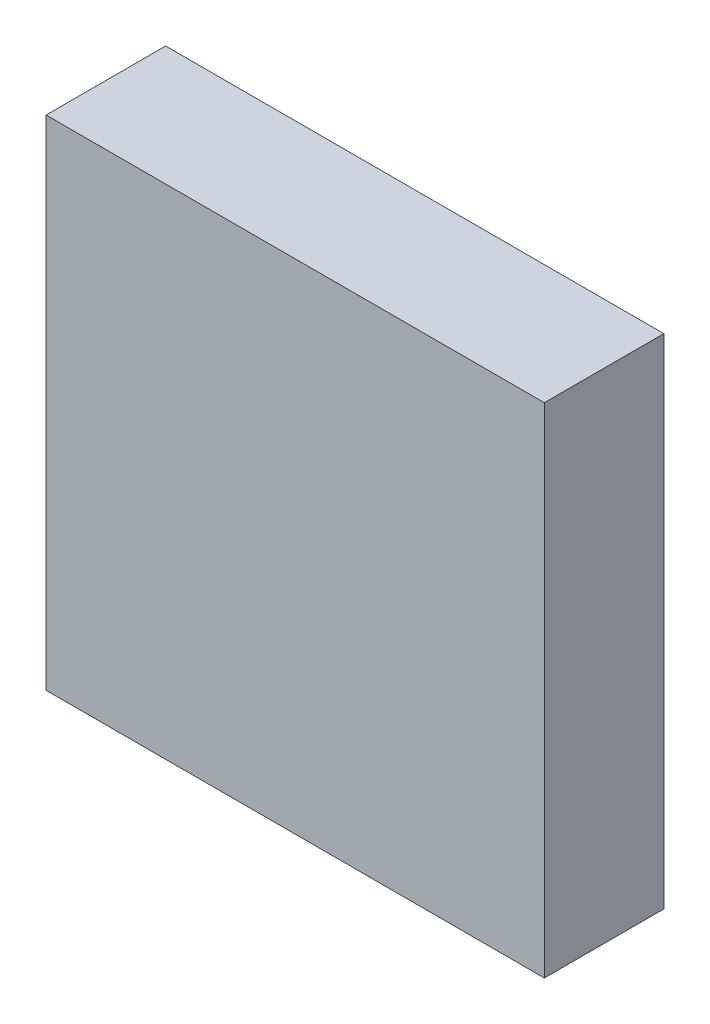
ISO-10303-21;
HEADER;
FILE_DESCRIPTION(('STEP AP214'),'2;1');
FILE_NAME('part.step','',(''),(''),'','','');
FILE_SCHEMA(('AUTOMOTIVE_DESIGN { 1 0 10303 214 1 1 1 1 }'));
ENDSEC;
DATA;
#1=APPLICATION_CONTEXT('core data for automotive mechanical design processes');
#2=APPLICATION_PROTOCOL_DEFINITION('international standard','automotive_design',2000,#1);
#3=PRODUCT_CONTEXT('',#1,'mechanical');
#4=PRODUCT('Part','Part','',(#3));
#5=PRODUCT_RELATED_PRODUCT_CATEGORY('part','',(#4));
#6=PRODUCT_DEFINITION_FORMATION('','',#4);
#7=PRODUCT_DEFINITION_CONTEXT('part definition',#1,'design');
#8=PRODUCT_DEFINITION('design','',#6,#7);
#9=PRODUCT_DEFINITION_SHAPE('','',#8);
#10=(LENGTH_UNIT() NAMED_UNIT(*) SI_UNIT(.MILLI.,.METRE.));
#11=(NAMED_UNIT(*) PLANE_ANGLE_UNIT() SI_UNIT($,.RADIAN.));
#12=(NAMED_UNIT(*) SI_UNIT($,.STERADIAN.) SOLID_ANGLE_UNIT());
#13=UNCERTAINTY_MEASURE_WITH_UNIT(LENGTH_MEASURE(1.E-05),#10,'distance_accuracy_value','');
#14=(GEOMETRIC_REPRESENTATION_CONTEXT(3) GLOBAL_UNCERTAINTY_ASSIGNED_CONTEXT((#13)) GLOBAL_UNIT_ASSIGNED_CONTEXT((#10,
#11,#12)) REPRESENTATION_CONTEXT('',''));
#15=CARTESIAN_POINT('',(0.,0.,0.));
#16=DIRECTION('',(0.,0.,1.));
#17=DIRECTION('',(1.,0.,0.));
#18=AXIS2_PLACEMENT_3D('',#15,#16,#17);
#19=CARTESIAN_POINT('',(16.,42.5,54.));
#20=DIRECTION('',(-1.,0.,0.));
#21=DIRECTION('',(0.,1.,0.));
#22=AXIS2_PLACEMENT_3D('',#19,#20,#21);
#23=PLANE('',#22);
#24=DIRECTION('',(0.,0.,1.));
#25=VECTOR('',#24,1.);
#26=CARTESIAN_POINT('',(16.,42.5,54.));
#27=LINE('',#26,#25);
#28=CARTESIAN_POINT('',(16.,42.5,54.));
#29=VERTEX_POINT('',#28);
#30=CARTESIAN_POINT('',(16.,42.5,60.));
#31=VERTEX_POINT('',#30);
#32=EDGE_CURVE('E66',#29,#31,#27,.T.);
#33=ORIENTED_EDGE('',*,*,#32,.T.);
#34=DIRECTION('',(0.,1.,0.));
#35=VECTOR('',#34,1.);
#36=CARTESIAN_POINT('',(16.,42.5,60.));
#37=LINE('',#36,#35);
#38=CARTESIAN_POINT('',(16.,67.5,60.));
#39=VERTEX_POINT('',#38);
#40=EDGE_CURVE('E114',#31,#39,#37,.T.);
#41=ORIENTED_EDGE('',*,*,#40,.T.);
#42=DIRECTION('',(0.,0.,1.));
#43=VECTOR('',#42,1.);
#44=CARTESIAN_POINT('',(16.,67.5,54.));
#45=LINE('',#44,#43);
#46=CARTESIAN_POINT('',(16.,67.5,54.));
#47=VERTEX_POINT('',#46);
#48=EDGE_CURVE('E69',#47,#39,#45,.T.);
#49=ORIENTED_EDGE('',*,*,#48,.F.);
#50=DIRECTION('',(0.,1.,0.));
#51=VECTOR('',#50,1.);
#52=CARTESIAN_POINT('',(16.,42.5,54.));
#53=LINE('',#52,#51);
#54=EDGE_CURVE('E11',#29,#47,#53,.T.);
#55=ORIENTED_EDGE('',*,*,#54,.F.);
#56=EDGE_LOOP('',(#33,#41,#49,#55));
#57=FACE_BOUND('',#56,.T.);
#58=ADVANCED_FACE('F17',(#57),#23,.T.);
#59=CARTESIAN_POINT('',(41.,42.5,54.));
#60=DIRECTION('',(0.,0.,-1.));
#61=DIRECTION('',(-1.,0.,0.));
#62=AXIS2_PLACEMENT_3D('',#59,#60,#61);
#63=PLANE('',#62);
#64=DIRECTION('',(-1.,0.,0.));
#65=VECTOR('',#64,1.);
#66=CARTESIAN_POINT('',(41.,42.5,54.));
#67=LINE('',#66,#65);
#68=CARTESIAN_POINT('',(41.,42.5,54.));
#69=VERTEX_POINT('',#68);
#70=EDGE_CURVE('E72',#69,#29,#67,.T.);
#71=ORIENTED_EDGE('',*,*,#70,.T.);
#72=ORIENTED_EDGE('',*,*,#54,.T.);
#73=DIRECTION('',(-1.,0.,0.));
#74=VECTOR('',#73,1.);
#75=CARTESIAN_POINT('',(41.,67.5,54.));
#76=LINE('',#75,#74);
#77=CARTESIAN_POINT('',(41.,67.5,54.));
#78=VERTEX_POINT('',#77);
#79=EDGE_CURVE('E100',#78,#47,#76,.T.);
#80=ORIENTED_EDGE('',*,*,#79,.F.);
#81=DIRECTION('',(0.,1.,0.));
#82=VECTOR('',#81,1.);
#83=CARTESIAN_POINT('',(41.,42.5,54.));
#84=LINE('',#83,#82);
#85=EDGE_CURVE('E28',#69,#78,#84,.T.);
#86=ORIENTED_EDGE('',*,*,#85,.F.);
#87=EDGE_LOOP('',(#71,#72,#80,#86));
#88=FACE_BOUND('',#87,.T.);
#89=ADVANCED_FACE('F73',(#88),#63,.T.);
#90=CARTESIAN_POINT('',(41.,42.5,60.));
#91=DIRECTION('',(1.,0.,0.));
#92=DIRECTION('',(0.,0.,-1.));
#93=AXIS2_PLACEMENT_3D('',#90,#91,#92);
#94=PLANE('',#93);
#95=DIRECTION('',(0.,0.,-1.));
#96=VECTOR('',#95,1.);
#97=CARTESIAN_POINT('',(41.,42.5,60.));
#98=LINE('',#97,#96);
#99=CARTESIAN_POINT('',(41.,42.5,60.));
#100=VERTEX_POINT('',#99);
#101=EDGE_CURVE('E78',#100,#69,#98,.T.);
#102=ORIENTED_EDGE('',*,*,#101,.T.);
#103=ORIENTED_EDGE('',*,*,#85,.T.);
#104=DIRECTION('',(0.,0.,-1.));
#105=VECTOR('',#104,1.);
#106=CARTESIAN_POINT('',(41.,67.5,60.));
#107=LINE('',#106,#105);
#108=CARTESIAN_POINT('',(41.,67.5,60.));
#109=VERTEX_POINT('',#108);
#110=EDGE_CURVE('E92',#109,#78,#107,.T.);
#111=ORIENTED_EDGE('',*,*,#110,.F.);
#112=DIRECTION('',(0.,1.,0.));
#113=VECTOR('',#112,1.);
#114=CARTESIAN_POINT('',(41.,42.5,60.));
#115=LINE('',#114,#113);
#116=EDGE_CURVE('E107',#100,#109,#115,.T.);
#117=ORIENTED_EDGE('',*,*,#116,.F.);
#118=EDGE_LOOP('',(#102,#103,#111,#117));
#119=FACE_BOUND('',#118,.T.);
#120=ADVANCED_FACE('F126',(#119),#94,.T.);
#121=CARTESIAN_POINT('',(16.,42.5,60.));
#122=DIRECTION('',(0.,0.,1.));
#123=DIRECTION('',(1.,0.,0.));
#124=AXIS2_PLACEMENT_3D('',#121,#122,#123);
#125=PLANE('',#124);
#126=DIRECTION('',(1.,0.,0.));
#127=VECTOR('',#126,1.);
#128=CARTESIAN_POINT('',(16.,42.5,60.));
#129=LINE('',#128,#127);
#130=EDGE_CURVE('E21',#31,#100,#129,.T.);
#131=ORIENTED_EDGE('',*,*,#130,.T.);
#132=ORIENTED_EDGE('',*,*,#116,.T.);
#133=DIRECTION('',(1.,0.,0.));
#134=VECTOR('',#133,1.);
#135=CARTESIAN_POINT('',(16.,67.5,60.));
#136=LINE('',#135,#134);
#137=EDGE_CURVE('E89',#39,#109,#136,.T.);
#138=ORIENTED_EDGE('',*,*,#137,.F.);
#139=ORIENTED_EDGE('',*,*,#40,.F.);
#140=EDGE_LOOP('',(#131,#132,#138,#139));
#141=FACE_BOUND('',#140,.T.);
#142=ADVANCED_FACE('F129',(#141),#125,.T.);
#143=CARTESIAN_POINT('',(28.5,67.5,57.));
#144=DIRECTION('',(0.,1.,0.));
#145=DIRECTION('',(1.,0.,0.));
#146=AXIS2_PLACEMENT_3D('',#143,#144,#145);
#147=PLANE('',#146);
#148=ORIENTED_EDGE('',*,*,#137,.T.);
#149=ORIENTED_EDGE('',*,*,#110,.T.);
#150=ORIENTED_EDGE('',*,*,#79,.T.);
#151=ORIENTED_EDGE('',*,*,#48,.T.);
#152=EDGE_LOOP('',(#148,#149,#150,#151));
#153=FACE_BOUND('',#152,.T.);
#154=ADVANCED_FACE('F127',(#153),#147,.T.);
#155=CARTESIAN_POINT('',(28.5,42.5,57.));
#156=DIRECTION('',(0.,1.,0.));
#157=DIRECTION('',(1.,0.,0.));
#158=AXIS2_PLACEMENT_3D('',#155,#156,#157);
#159=PLANE('',#158);
#160=ORIENTED_EDGE('',*,*,#130,.F.);
#161=ORIENTED_EDGE('',*,*,#32,.F.);
#162=ORIENTED_EDGE('',*,*,#70,.F.);
#163=ORIENTED_EDGE('',*,*,#101,.F.);
#164=EDGE_LOOP('',(#160,#161,#162,#163));
#165=FACE_BOUND('',#164,.T.);
#166=ADVANCED_FACE('F19',(#165),#159,.F.);
#167=CLOSED_SHELL('',(#58,#89,#120,#142,#154,#166));
#168=MANIFOLD_SOLID_BREP('B1',#167);
#169=ADVANCED_BREP_SHAPE_REPRESENTATION('',(#18,#168),#14);
#170=SHAPE_DEFINITION_REPRESENTATION(#9,#169);
ENDSEC;
END-ISO-10303-21;
